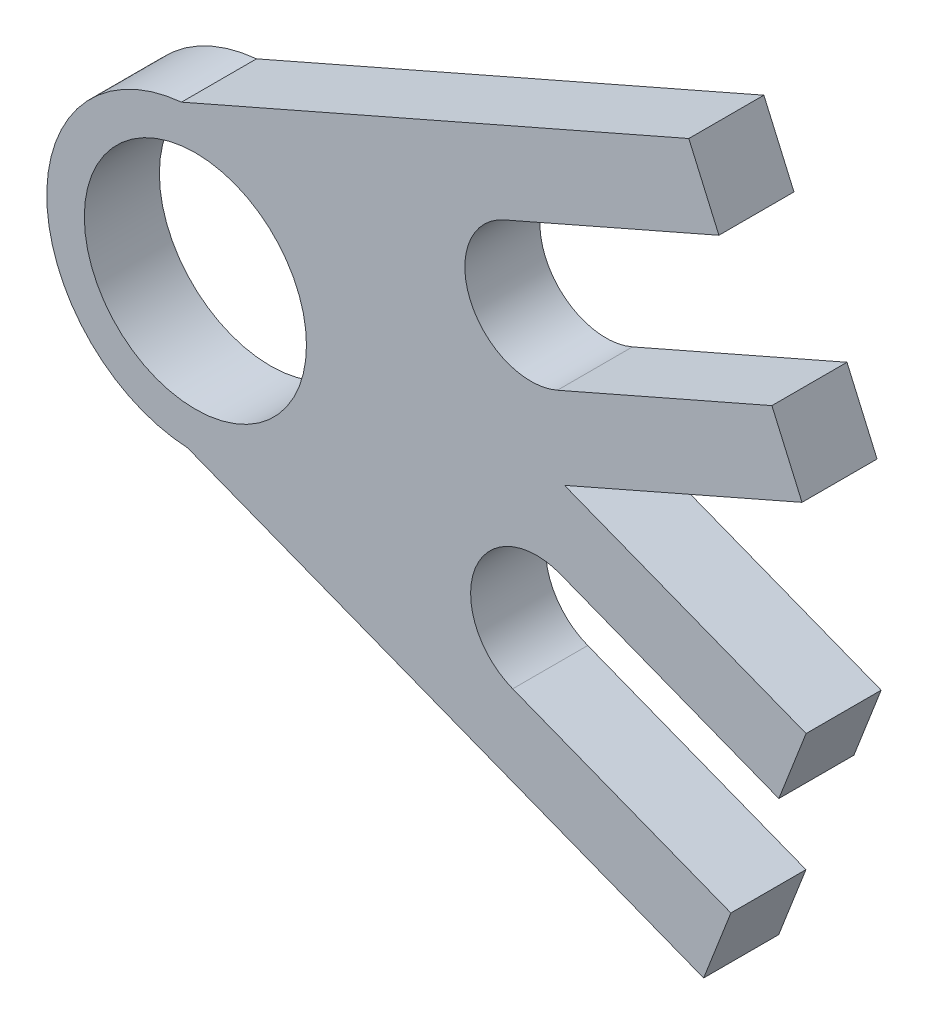
ISO-10303-21;
HEADER;
FILE_DESCRIPTION(('STEP AP214'),'2;1');
FILE_NAME('part.step','',(''),(''),'','','');
FILE_SCHEMA(('AUTOMOTIVE_DESIGN { 1 0 10303 214 1 1 1 1 }'));
ENDSEC;
DATA;
#1=APPLICATION_CONTEXT('core data for automotive mechanical design processes');
#2=APPLICATION_PROTOCOL_DEFINITION('international standard','automotive_design',2000,#1);
#3=PRODUCT_CONTEXT('',#1,'mechanical');
#4=PRODUCT('Part','Part','',(#3));
#5=PRODUCT_RELATED_PRODUCT_CATEGORY('part','',(#4));
#6=PRODUCT_DEFINITION_FORMATION('','',#4);
#7=PRODUCT_DEFINITION_CONTEXT('part definition',#1,'design');
#8=PRODUCT_DEFINITION('design','',#6,#7);
#9=PRODUCT_DEFINITION_SHAPE('','',#8);
#10=(LENGTH_UNIT() NAMED_UNIT(*) SI_UNIT(.MILLI.,.METRE.));
#11=(NAMED_UNIT(*) PLANE_ANGLE_UNIT() SI_UNIT($,.RADIAN.));
#12=(NAMED_UNIT(*) SI_UNIT($,.STERADIAN.) SOLID_ANGLE_UNIT());
#13=UNCERTAINTY_MEASURE_WITH_UNIT(LENGTH_MEASURE(1.E-05),#10,'distance_accuracy_value','');
#14=(GEOMETRIC_REPRESENTATION_CONTEXT(3) GLOBAL_UNCERTAINTY_ASSIGNED_CONTEXT((#13)) GLOBAL_UNIT_ASSIGNED_CONTEXT((#10,
#11,#12)) REPRESENTATION_CONTEXT('',''));
#15=CARTESIAN_POINT('',(0.,0.,0.));
#16=DIRECTION('',(0.,0.,1.));
#17=DIRECTION('',(1.,0.,0.));
#18=AXIS2_PLACEMENT_3D('',#15,#16,#17);
#19=CARTESIAN_POINT('',(-581.214542671151,3.54310745627306,3.175));
#20=DIRECTION('',(0.,0.,-1.));
#21=DIRECTION('',(-1.,0.,0.));
#22=AXIS2_PLACEMENT_3D('',#19,#20,#21);
#23=CYLINDRICAL_SURFACE('',#22,5.58800000000007);
#24=CARTESIAN_POINT('',(-581.214542671151,3.54310745627306,-3.175));
#25=DIRECTION('',(0.,0.,1.));
#26=DIRECTION('',(1.,0.,0.));
#27=AXIS2_PLACEMENT_3D('',#24,#25,#26);
#28=CIRCLE('',#27,5.58800000000007);
#29=CARTESIAN_POINT('',(-583.45614179897,8.66179648278773,-3.175));
#30=VERTEX_POINT('',#29);
#31=CARTESIAN_POINT('',(-578.972943543332,-1.57558157024162,-3.175));
#32=VERTEX_POINT('',#31);
#33=EDGE_CURVE('E175',#30,#32,#28,.T.);
#34=ORIENTED_EDGE('',*,*,#33,.F.);
#35=DIRECTION('',(0.,0.,-1.));
#36=VECTOR('',#35,1.);
#37=CARTESIAN_POINT('',(-583.45614179897,8.66179648278773,3.175));
#38=LINE('',#37,#36);
#39=CARTESIAN_POINT('',(-583.45614179897,8.66179648278773,3.175));
#40=VERTEX_POINT('',#39);
#41=EDGE_CURVE('E11',#40,#30,#38,.T.);
#42=ORIENTED_EDGE('',*,*,#41,.F.);
#43=CARTESIAN_POINT('',(-581.214542671151,3.54310745627306,3.175));
#44=DIRECTION('',(0.,0.,1.));
#45=DIRECTION('',(1.,0.,0.));
#46=AXIS2_PLACEMENT_3D('',#43,#44,#45);
#47=CIRCLE('',#46,5.58800000000007);
#48=CARTESIAN_POINT('',(-578.972943543332,-1.57558157024162,3.175));
#49=VERTEX_POINT('',#48);
#50=EDGE_CURVE('E214',#40,#49,#47,.T.);
#51=ORIENTED_EDGE('',*,*,#50,.T.);
#52=DIRECTION('',(0.,0.,-1.));
#53=VECTOR('',#52,1.);
#54=CARTESIAN_POINT('',(-578.972943543332,-1.57558157024162,3.175));
#55=LINE('',#54,#53);
#56=EDGE_CURVE('E52',#49,#32,#55,.T.);
#57=ORIENTED_EDGE('',*,*,#56,.T.);
#58=EDGE_LOOP('',(#34,#42,#51,#57));
#59=FACE_BOUND('',#58,.T.);
#60=ADVANCED_FACE('F36',(#59),#23,.F.);
#61=CARTESIAN_POINT('',(-97.0710846470642,221.661709985696,3.175));
#62=DIRECTION('',(-0.401145155300462,0.916014500092094,0.));
#63=DIRECTION('',(-0.916014500092094,-0.401145155300462,0.));
#64=AXIS2_PLACEMENT_3D('',#61,#62,#63);
#65=PLANE('',#64);
#66=DIRECTION('',(0.916014500092094,0.401145155300462,0.));
#67=VECTOR('',#66,1.);
#68=CARTESIAN_POINT('',(-97.0710846470642,221.661709985696,-3.175));
#69=LINE('',#68,#67);
#70=CARTESIAN_POINT('',(-565.30806252314,16.6092842996026,-3.175));
#71=VERTEX_POINT('',#70);
#72=EDGE_CURVE('E177',#30,#71,#69,.T.);
#73=ORIENTED_EDGE('',*,*,#72,.T.);
#74=DIRECTION('',(0.,0.,-1.));
#75=VECTOR('',#74,1.);
#76=CARTESIAN_POINT('',(-565.30806252314,16.6092842996026,3.175));
#77=LINE('',#76,#75);
#78=CARTESIAN_POINT('',(-565.30806252314,16.6092842996026,3.175));
#79=VERTEX_POINT('',#78);
#80=EDGE_CURVE('E44',#79,#71,#77,.T.);
#81=ORIENTED_EDGE('',*,*,#80,.F.);
#82=DIRECTION('',(0.916014500092094,0.401145155300462,0.));
#83=VECTOR('',#82,1.);
#84=CARTESIAN_POINT('',(-97.0710846470642,221.661709985696,3.175));
#85=LINE('',#84,#83);
#86=EDGE_CURVE('E470',#40,#79,#85,.T.);
#87=ORIENTED_EDGE('',*,*,#86,.F.);
#88=ORIENTED_EDGE('',*,*,#41,.T.);
#89=EDGE_LOOP('',(#73,#81,#87,#88));
#90=FACE_BOUND('',#89,.T.);
#91=ADVANCED_FACE('F307',(#90),#65,.F.);
#92=CARTESIAN_POINT('',(-468.236977876058,-205.052425686108,3.175));
#93=DIRECTION('',(-0.916014500092077,-0.4011451553005,0.));
#94=DIRECTION('',(0.4011451553005,-0.916014500092077,0.));
#95=AXIS2_PLACEMENT_3D('',#92,#93,#94);
#96=PLANE('',#95);
#97=DIRECTION('',(-0.4011451553005,0.916014500092077,0.));
#98=VECTOR('',#97,1.);
#99=CARTESIAN_POINT('',(-468.236977876058,-205.052425686108,-3.175));
#100=LINE('',#99,#98);
#101=CARTESIAN_POINT('',(-567.855334259299,22.4259763751874,-3.175));
#102=VERTEX_POINT('',#101);
#103=EDGE_CURVE('E179',#71,#102,#100,.T.);
#104=ORIENTED_EDGE('',*,*,#103,.T.);
#105=DIRECTION('',(0.,0.,-1.));
#106=VECTOR('',#105,1.);
#107=CARTESIAN_POINT('',(-567.855334259299,22.4259763751874,3.175));
#108=LINE('',#107,#106);
#109=CARTESIAN_POINT('',(-567.855334259299,22.4259763751874,3.175));
#110=VERTEX_POINT('',#109);
#111=EDGE_CURVE('E237',#110,#102,#108,.T.);
#112=ORIENTED_EDGE('',*,*,#111,.F.);
#113=DIRECTION('',(-0.4011451553005,0.916014500092077,0.));
#114=VECTOR('',#113,1.);
#115=CARTESIAN_POINT('',(-468.236977876058,-205.052425686108,3.175));
#116=LINE('',#115,#114);
#117=EDGE_CURVE('E246',#79,#110,#116,.T.);
#118=ORIENTED_EDGE('',*,*,#117,.F.);
#119=ORIENTED_EDGE('',*,*,#80,.T.);
#120=EDGE_LOOP('',(#104,#112,#118,#119));
#121=FACE_BOUND('',#120,.T.);
#122=ADVANCED_FACE('F244',(#121),#96,.F.);
#123=CARTESIAN_POINT('',(-99.6183563832226,227.478402061281,3.175));
#124=DIRECTION('',(0.401145155300463,-0.916014500092093,0.));
#125=DIRECTION('',(0.916014500092093,0.401145155300463,0.));
#126=AXIS2_PLACEMENT_3D('',#123,#124,#125);
#127=PLANE('',#126);
#128=DIRECTION('',(-0.916014500092093,-0.401145155300463,0.));
#129=VECTOR('',#128,1.);
#130=CARTESIAN_POINT('',(-99.6183563832226,227.478402061281,-3.175));
#131=LINE('',#130,#129);
#132=CARTESIAN_POINT('',(-610.775024161772,3.63039435149163,-3.175));
#133=VERTEX_POINT('',#132);
#134=EDGE_CURVE('E181',#102,#133,#131,.T.);
#135=ORIENTED_EDGE('',*,*,#134,.T.);
#136=DIRECTION('',(0.,0.,-1.));
#137=VECTOR('',#136,1.);
#138=CARTESIAN_POINT('',(-610.775024161772,3.63039435149163,3.175));
#139=LINE('',#138,#137);
#140=CARTESIAN_POINT('',(-610.775024161772,3.63039435149163,3.175));
#141=VERTEX_POINT('',#140);
#142=EDGE_CURVE('E234',#141,#133,#139,.T.);
#143=ORIENTED_EDGE('',*,*,#142,.F.);
#144=DIRECTION('',(-0.916014500092093,-0.401145155300463,0.));
#145=VECTOR('',#144,1.);
#146=CARTESIAN_POINT('',(-99.6183563832226,227.478402061281,3.175));
#147=LINE('',#146,#145);
#148=EDGE_CURVE('E266',#110,#141,#147,.T.);
#149=ORIENTED_EDGE('',*,*,#148,.F.);
#150=ORIENTED_EDGE('',*,*,#111,.T.);
#151=EDGE_LOOP('',(#135,#143,#149,#150));
#152=FACE_BOUND('',#151,.T.);
#153=ADVANCED_FACE('F256',(#152),#127,.F.);
#154=CARTESIAN_POINT('',(-609.6,-8.88757861617569,3.175));
#155=DIRECTION('',(0.,0.,-1.));
#156=DIRECTION('',(-1.,0.,0.));
#157=AXIS2_PLACEMENT_3D('',#154,#155,#156);
#158=CYLINDRICAL_SURFACE('',#157,12.5729999999999);
#159=CARTESIAN_POINT('',(-609.6,-8.88757861617569,-3.175));
#160=DIRECTION('',(0.,0.,1.));
#161=DIRECTION('',(1.,0.,0.));
#162=AXIS2_PLACEMENT_3D('',#159,#160,#161);
#163=CIRCLE('',#162,12.5729999999999);
#164=CARTESIAN_POINT('',(-610.258379573321,-21.4433289058809,-3.175));
#165=VERTEX_POINT('',#164);
#166=EDGE_CURVE('E183',#133,#165,#163,.T.);
#167=ORIENTED_EDGE('',*,*,#166,.T.);
#168=DIRECTION('',(0.,0.,-1.));
#169=VECTOR('',#168,1.);
#170=CARTESIAN_POINT('',(-610.258379573321,-21.4433289058809,3.175));
#171=LINE('',#170,#169);
#172=CARTESIAN_POINT('',(-610.258379573321,-21.4433289058809,3.175));
#173=VERTEX_POINT('',#172);
#174=EDGE_CURVE('E232',#173,#165,#171,.T.);
#175=ORIENTED_EDGE('',*,*,#174,.F.);
#176=CARTESIAN_POINT('',(-609.6,-8.88757861617569,3.175));
#177=DIRECTION('',(0.,0.,1.));
#178=DIRECTION('',(1.,0.,0.));
#179=AXIS2_PLACEMENT_3D('',#176,#177,#178);
#180=CIRCLE('',#179,12.5729999999999);
#181=EDGE_CURVE('E262',#141,#173,#180,.T.);
#182=ORIENTED_EDGE('',*,*,#181,.F.);
#183=ORIENTED_EDGE('',*,*,#142,.T.);
#184=EDGE_LOOP('',(#167,#175,#182,#183));
#185=FACE_BOUND('',#184,.T.);
#186=ADVANCED_FACE('F260',(#185),#158,.T.);
#187=CARTESIAN_POINT('',(-87.6991004533568,-225.064690467357,3.175));
#188=DIRECTION('',(-0.363071698537952,-0.931761204236776,0.));
#189=DIRECTION('',(0.931761204236776,-0.363071698537952,0.));
#190=AXIS2_PLACEMENT_3D('',#187,#188,#189);
#191=PLANE('',#190);
#192=DIRECTION('',(-0.931761204236776,0.363071698537952,0.));
#193=VECTOR('',#192,1.);
#194=CARTESIAN_POINT('',(-87.6991004533568,-225.064690467357,-3.175));
#195=LINE('',#194,#193);
#196=CARTESIAN_POINT('',(-566.600880761918,-38.4549861580823,-3.175));
#197=VERTEX_POINT('',#196);
#198=EDGE_CURVE('E186',#197,#165,#195,.T.);
#199=ORIENTED_EDGE('',*,*,#198,.F.);
#200=DIRECTION('',(0.,0.,-1.));
#201=VECTOR('',#200,1.);
#202=CARTESIAN_POINT('',(-566.600880761918,-38.4549861580823,3.175));
#203=LINE('',#202,#201);
#204=CARTESIAN_POINT('',(-566.600880761918,-38.4549861580823,3.175));
#205=VERTEX_POINT('',#204);
#206=EDGE_CURVE('E230',#205,#197,#203,.T.);
#207=ORIENTED_EDGE('',*,*,#206,.F.);
#208=DIRECTION('',(-0.931761204236776,0.363071698537952,0.));
#209=VECTOR('',#208,1.);
#210=CARTESIAN_POINT('',(-87.6991004533568,-225.064690467357,3.175));
#211=LINE('',#210,#209);
#212=EDGE_CURVE('E265',#205,#173,#211,.T.);
#213=ORIENTED_EDGE('',*,*,#212,.T.);
#214=ORIENTED_EDGE('',*,*,#174,.T.);
#215=EDGE_LOOP('',(#199,#207,#213,#214));
#216=FACE_BOUND('',#215,.T.);
#217=ADVANCED_FACE('F320',(#216),#191,.T.);
#218=CARTESIAN_POINT('',(-478.90178030859,186.609704309248,3.175));
#219=DIRECTION('',(0.931761204236801,-0.363071698537887,0.));
#220=DIRECTION('',(0.363071698537888,0.931761204236801,0.));
#221=AXIS2_PLACEMENT_3D('',#218,#219,#220);
#222=PLANE('',#221);
#223=DIRECTION('',(-0.363071698537887,-0.931761204236801,0.));
#224=VECTOR('',#223,1.);
#225=CARTESIAN_POINT('',(-478.90178030859,186.609704309248,-3.175));
#226=LINE('',#225,#224);
#227=CARTESIAN_POINT('',(-564.295375476203,-32.5383025111786,-3.175));
#228=VERTEX_POINT('',#227);
#229=EDGE_CURVE('E189',#228,#197,#226,.T.);
#230=ORIENTED_EDGE('',*,*,#229,.F.);
#231=DIRECTION('',(0.,0.,-1.));
#232=VECTOR('',#231,1.);
#233=CARTESIAN_POINT('',(-564.295375476203,-32.5383025111786,3.175));
#234=LINE('',#233,#232);
#235=CARTESIAN_POINT('',(-564.295375476203,-32.5383025111786,3.175));
#236=VERTEX_POINT('',#235);
#237=EDGE_CURVE('E228',#236,#228,#234,.T.);
#238=ORIENTED_EDGE('',*,*,#237,.F.);
#239=DIRECTION('',(-0.363071698537887,-0.931761204236801,0.));
#240=VECTOR('',#239,1.);
#241=CARTESIAN_POINT('',(-478.90178030859,186.609704309248,3.175));
#242=LINE('',#241,#240);
#243=EDGE_CURVE('E268',#236,#205,#242,.T.);
#244=ORIENTED_EDGE('',*,*,#243,.T.);
#245=ORIENTED_EDGE('',*,*,#206,.T.);
#246=EDGE_LOOP('',(#230,#238,#244,#245));
#247=FACE_BOUND('',#246,.T.);
#248=ADVANCED_FACE('F323',(#247),#222,.T.);
#249=CARTESIAN_POINT('',(-85.3935951676427,-219.148006820455,3.175));
#250=DIRECTION('',(0.363071698537956,0.931761204236774,0.));
#251=DIRECTION('',(-0.931761204236774,0.363071698537956,0.));
#252=AXIS2_PLACEMENT_3D('',#249,#250,#251);
#253=PLANE('',#252);
#254=DIRECTION('',(0.931761204236774,-0.363071698537956,0.));
#255=VECTOR('',#254,1.);
#256=CARTESIAN_POINT('',(-85.3935951676427,-219.148006820455,-3.175));
#257=LINE('',#256,#255);
#258=CARTESIAN_POINT('',(-582.755428454541,-25.345126019745,-3.175));
#259=VERTEX_POINT('',#258);
#260=EDGE_CURVE('E192',#259,#228,#257,.T.);
#261=ORIENTED_EDGE('',*,*,#260,.F.);
#262=DIRECTION('',(0.,0.,-1.));
#263=VECTOR('',#262,1.);
#264=CARTESIAN_POINT('',(-582.755428454541,-25.345126019745,3.175));
#265=LINE('',#264,#263);
#266=CARTESIAN_POINT('',(-582.755428454541,-25.345126019745,3.175));
#267=VERTEX_POINT('',#266);
#268=EDGE_CURVE('E226',#267,#259,#265,.T.);
#269=ORIENTED_EDGE('',*,*,#268,.F.);
#270=DIRECTION('',(0.931761204236774,-0.363071698537956,0.));
#271=VECTOR('',#270,1.);
#272=CARTESIAN_POINT('',(-85.3935951676427,-219.148006820455,3.175));
#273=LINE('',#272,#271);
#274=EDGE_CURVE('E275',#267,#236,#273,.T.);
#275=ORIENTED_EDGE('',*,*,#274,.T.);
#276=ORIENTED_EDGE('',*,*,#237,.T.);
#277=EDGE_LOOP('',(#261,#269,#275,#276));
#278=FACE_BOUND('',#277,.T.);
#279=ADVANCED_FACE('F327',(#278),#253,.T.);
#280=CARTESIAN_POINT('',(-580.726583803111,-20.1384444104696,3.175));
#281=DIRECTION('',(0.,0.,-1.));
#282=DIRECTION('',(-1.,0.,0.));
#283=AXIS2_PLACEMENT_3D('',#280,#281,#282);
#284=CYLINDRICAL_SURFACE('',#283,5.58800000000019);
#285=CARTESIAN_POINT('',(-580.726583803111,-20.1384444104696,-3.175));
#286=DIRECTION('',(0.,0.,1.));
#287=DIRECTION('',(1.,0.,0.));
#288=AXIS2_PLACEMENT_3D('',#285,#286,#287);
#289=CIRCLE('',#288,5.58800000000019);
#290=CARTESIAN_POINT('',(-578.697739151681,-14.9317628011944,-3.175));
#291=VERTEX_POINT('',#290);
#292=EDGE_CURVE('E195',#291,#259,#289,.T.);
#293=ORIENTED_EDGE('',*,*,#292,.F.);
#294=DIRECTION('',(0.,0.,-1.));
#295=VECTOR('',#294,1.);
#296=CARTESIAN_POINT('',(-578.697739151681,-14.9317628011944,3.175));
#297=LINE('',#296,#295);
#298=CARTESIAN_POINT('',(-578.697739151681,-14.9317628011944,3.175));
#299=VERTEX_POINT('',#298);
#300=EDGE_CURVE('E224',#299,#291,#297,.T.);
#301=ORIENTED_EDGE('',*,*,#300,.F.);
#302=CARTESIAN_POINT('',(-580.726583803111,-20.1384444104696,3.175));
#303=DIRECTION('',(0.,0.,1.));
#304=DIRECTION('',(1.,0.,0.));
#305=AXIS2_PLACEMENT_3D('',#302,#303,#304);
#306=CIRCLE('',#305,5.58800000000019);
#307=EDGE_CURVE('E278',#299,#267,#306,.T.);
#308=ORIENTED_EDGE('',*,*,#307,.T.);
#309=ORIENTED_EDGE('',*,*,#268,.T.);
#310=EDGE_LOOP('',(#293,#301,#308,#309));
#311=FACE_BOUND('',#310,.T.);
#312=ADVANCED_FACE('F331',(#311),#284,.F.);
#313=CARTESIAN_POINT('',(-81.3359058647786,-208.734643601901,3.175));
#314=DIRECTION('',(0.363071698537947,0.931761204236777,0.));
#315=DIRECTION('',(-0.931761204236778,0.363071698537948,0.));
#316=AXIS2_PLACEMENT_3D('',#313,#314,#315);
#317=PLANE('',#316);
#318=DIRECTION('',(0.931761204236778,-0.363071698537948,0.));
#319=VECTOR('',#318,1.);
#320=CARTESIAN_POINT('',(-81.3359058647786,-208.734643601901,-3.175));
#321=LINE('',#320,#319);
#322=CARTESIAN_POINT('',(-560.237686173343,-22.1249392926279,-3.175));
#323=VERTEX_POINT('',#322);
#324=EDGE_CURVE('E198',#291,#323,#321,.T.);
#325=ORIENTED_EDGE('',*,*,#324,.T.);
#326=DIRECTION('',(0.,0.,-1.));
#327=VECTOR('',#326,1.);
#328=CARTESIAN_POINT('',(-560.237686173343,-22.1249392926279,3.175));
#329=LINE('',#328,#327);
#330=CARTESIAN_POINT('',(-560.237686173343,-22.1249392926279,3.175));
#331=VERTEX_POINT('',#330);
#332=EDGE_CURVE('E221',#331,#323,#329,.T.);
#333=ORIENTED_EDGE('',*,*,#332,.F.);
#334=DIRECTION('',(0.931761204236778,-0.363071698537948,0.));
#335=VECTOR('',#334,1.);
#336=CARTESIAN_POINT('',(-81.3359058647786,-208.734643601901,3.175));
#337=LINE('',#336,#335);
#338=EDGE_CURVE('E281',#299,#331,#337,.T.);
#339=ORIENTED_EDGE('',*,*,#338,.F.);
#340=ORIENTED_EDGE('',*,*,#300,.T.);
#341=EDGE_LOOP('',(#325,#333,#339,#340));
#342=FACE_BOUND('',#341,.T.);
#343=ADVANCED_FACE('F335',(#342),#317,.F.);
#344=CARTESIAN_POINT('',(-478.901780308537,186.6097043093,3.175));
#345=DIRECTION('',(-0.931761204236753,0.363071698538011,0.));
#346=DIRECTION('',(-0.363071698538011,-0.931761204236753,0.));
#347=AXIS2_PLACEMENT_3D('',#344,#345,#346);
#348=PLANE('',#347);
#349=DIRECTION('',(0.363071698538011,0.931761204236753,0.));
#350=VECTOR('',#349,1.);
#351=CARTESIAN_POINT('',(-478.901780308537,186.6097043093,-3.175));
#352=LINE('',#351,#350);
#353=CARTESIAN_POINT('',(-557.932180887626,-16.2082556457244,-3.175));
#354=VERTEX_POINT('',#353);
#355=EDGE_CURVE('E200',#323,#354,#352,.T.);
#356=ORIENTED_EDGE('',*,*,#355,.T.);
#357=DIRECTION('',(0.,0.,-1.));
#358=VECTOR('',#357,1.);
#359=CARTESIAN_POINT('',(-557.932180887626,-16.2082556457244,3.175));
#360=LINE('',#359,#358);
#361=CARTESIAN_POINT('',(-557.932180887626,-16.2082556457244,3.175));
#362=VERTEX_POINT('',#361);
#363=EDGE_CURVE('E218',#362,#354,#360,.T.);
#364=ORIENTED_EDGE('',*,*,#363,.F.);
#365=DIRECTION('',(0.363071698538011,0.931761204236753,0.));
#366=VECTOR('',#365,1.);
#367=CARTESIAN_POINT('',(-478.901780308537,186.6097043093,3.175));
#368=LINE('',#367,#366);
#369=EDGE_CURVE('E283',#331,#362,#368,.T.);
#370=ORIENTED_EDGE('',*,*,#369,.F.);
#371=ORIENTED_EDGE('',*,*,#332,.T.);
#372=EDGE_LOOP('',(#356,#364,#370,#371));
#373=FACE_BOUND('',#372,.T.);
#374=ADVANCED_FACE('F290',(#373),#348,.F.);
#375=CARTESIAN_POINT('',(-79.0304005790641,-202.817959954999,3.175));
#376=DIRECTION('',(-0.363071698537951,-0.931761204236776,0.));
#377=DIRECTION('',(0.931761204236776,-0.363071698537951,0.));
#378=AXIS2_PLACEMENT_3D('',#375,#376,#377);
#379=PLANE('',#378);
#380=DIRECTION('',(-0.931761204236776,0.363071698537951,0.));
#381=VECTOR('',#380,1.);
#382=CARTESIAN_POINT('',(-79.0304005790641,-202.817959954999,-3.175));
#383=LINE('',#382,#381);
#384=CARTESIAN_POINT('',(-578.370817833612,-8.24410066906603,-3.175));
#385=VERTEX_POINT('',#384);
#386=EDGE_CURVE('E202',#354,#385,#383,.T.);
#387=ORIENTED_EDGE('',*,*,#386,.T.);
#388=DIRECTION('',(0.,0.,-1.));
#389=VECTOR('',#388,1.);
#390=CARTESIAN_POINT('',(-578.370817833612,-8.24410066906603,3.175));
#391=LINE('',#390,#389);
#392=CARTESIAN_POINT('',(-578.370817833612,-8.24410066906603,3.175));
#393=VERTEX_POINT('',#392);
#394=EDGE_CURVE('E153',#393,#385,#391,.T.);
#395=ORIENTED_EDGE('',*,*,#394,.F.);
#396=DIRECTION('',(-0.931761204236776,0.363071698537951,0.));
#397=VECTOR('',#396,1.);
#398=CARTESIAN_POINT('',(-79.0304005790641,-202.817959954999,3.175));
#399=LINE('',#398,#397);
#400=EDGE_CURVE('E163',#362,#393,#399,.T.);
#401=ORIENTED_EDGE('',*,*,#400,.F.);
#402=ORIENTED_EDGE('',*,*,#363,.T.);
#403=EDGE_LOOP('',(#387,#395,#401,#402));
#404=FACE_BOUND('',#403,.T.);
#405=ADVANCED_FACE('F294',(#404),#379,.F.);
#406=CARTESIAN_POINT('',(-90.0406146552676,205.607639857081,3.175));
#407=DIRECTION('',(0.401145155300461,-0.916014500092094,0.));
#408=DIRECTION('',(0.916014500092094,0.401145155300461,0.));
#409=AXIS2_PLACEMENT_3D('',#406,#407,#408);
#410=PLANE('',#409);
#411=DIRECTION('',(-0.916014500092094,-0.401145155300461,0.));
#412=VECTOR('',#411,1.);
#413=CARTESIAN_POINT('',(-90.0406146552676,205.607639857081,-3.175));
#414=LINE('',#413,#412);
#415=CARTESIAN_POINT('',(-558.277592531345,0.555214170988277,-3.175));
#416=VERTEX_POINT('',#415);
#417=EDGE_CURVE('E149',#416,#385,#414,.T.);
#418=ORIENTED_EDGE('',*,*,#417,.F.);
#419=DIRECTION('',(0.,0.,-1.));
#420=VECTOR('',#419,1.);
#421=CARTESIAN_POINT('',(-558.277592531345,0.555214170988277,3.175));
#422=LINE('',#421,#420);
#423=CARTESIAN_POINT('',(-558.277592531345,0.555214170988277,3.175));
#424=VERTEX_POINT('',#423);
#425=EDGE_CURVE('E144',#424,#416,#422,.T.);
#426=ORIENTED_EDGE('',*,*,#425,.F.);
#427=DIRECTION('',(-0.916014500092094,-0.401145155300461,0.));
#428=VECTOR('',#427,1.);
#429=CARTESIAN_POINT('',(-90.0406146552676,205.607639857081,3.175));
#430=LINE('',#429,#428);
#431=EDGE_CURVE('E147',#424,#393,#430,.T.);
#432=ORIENTED_EDGE('',*,*,#431,.T.);
#433=ORIENTED_EDGE('',*,*,#394,.T.);
#434=EDGE_LOOP('',(#418,#426,#432,#433));
#435=FACE_BOUND('',#434,.T.);
#436=ADVANCED_FACE('F146',(#435),#410,.T.);
#437=CARTESIAN_POINT('',(-468.236977876091,-205.052425686079,3.175));
#438=DIRECTION('',(0.916014500092108,0.401145155300429,0.));
#439=DIRECTION('',(-0.401145155300429,0.916014500092108,0.));
#440=AXIS2_PLACEMENT_3D('',#437,#438,#439);
#441=PLANE('',#440);
#442=DIRECTION('',(0.401145155300429,-0.916014500092108,0.));
#443=VECTOR('',#442,1.);
#444=CARTESIAN_POINT('',(-468.236977876091,-205.052425686079,-3.175));
#445=LINE('',#444,#443);
#446=CARTESIAN_POINT('',(-560.824864267502,6.37190624657327,-3.175));
#447=VERTEX_POINT('',#446);
#448=EDGE_CURVE('E206',#447,#416,#445,.T.);
#449=ORIENTED_EDGE('',*,*,#448,.F.);
#450=DIRECTION('',(0.,0.,-1.));
#451=VECTOR('',#450,1.);
#452=CARTESIAN_POINT('',(-560.824864267502,6.37190624657327,3.175));
#453=LINE('',#452,#451);
#454=CARTESIAN_POINT('',(-560.824864267502,6.37190624657327,3.175));
#455=VERTEX_POINT('',#454);
#456=EDGE_CURVE('E98',#455,#447,#453,.T.);
#457=ORIENTED_EDGE('',*,*,#456,.F.);
#458=DIRECTION('',(0.401145155300429,-0.916014500092108,0.));
#459=VECTOR('',#458,1.);
#460=CARTESIAN_POINT('',(-468.236977876091,-205.052425686079,3.175));
#461=LINE('',#460,#459);
#462=EDGE_CURVE('E161',#455,#424,#461,.T.);
#463=ORIENTED_EDGE('',*,*,#462,.T.);
#464=ORIENTED_EDGE('',*,*,#425,.T.);
#465=EDGE_LOOP('',(#449,#457,#463,#464));
#466=FACE_BOUND('',#465,.T.);
#467=ADVANCED_FACE('F166',(#466),#441,.T.);
#468=CARTESIAN_POINT('',(-92.5878863914263,211.424331932666,3.175));
#469=DIRECTION('',(-0.401145155300462,0.916014500092094,0.));
#470=DIRECTION('',(-0.916014500092094,-0.401145155300462,0.));
#471=AXIS2_PLACEMENT_3D('',#468,#469,#470);
#472=PLANE('',#471);
#473=DIRECTION('',(0.916014500092094,0.401145155300462,0.));
#474=VECTOR('',#473,1.);
#475=CARTESIAN_POINT('',(-92.5878863914263,211.424331932666,-3.175));
#476=LINE('',#475,#474);
#477=EDGE_CURVE('E208',#32,#447,#476,.T.);
#478=ORIENTED_EDGE('',*,*,#477,.F.);
#479=ORIENTED_EDGE('',*,*,#56,.F.);
#480=DIRECTION('',(0.916014500092094,0.401145155300462,0.));
#481=VECTOR('',#480,1.);
#482=CARTESIAN_POINT('',(-92.5878863914263,211.424331932666,3.175));
#483=LINE('',#482,#481);
#484=EDGE_CURVE('E167',#49,#455,#483,.T.);
#485=ORIENTED_EDGE('',*,*,#484,.T.);
#486=ORIENTED_EDGE('',*,*,#456,.T.);
#487=EDGE_LOOP('',(#478,#479,#485,#486));
#488=FACE_BOUND('',#487,.T.);
#489=ADVANCED_FACE('F295',(#488),#472,.T.);
#490=CARTESIAN_POINT('',(-609.6,-8.88757861617569,3.175));
#491=DIRECTION('',(0.,0.,-1.));
#492=DIRECTION('',(-1.,0.,0.));
#493=AXIS2_PLACEMENT_3D('',#490,#491,#492);
#494=CYLINDRICAL_SURFACE('',#493,9.39800000000006);
#495=CARTESIAN_POINT('',(-609.6,-8.88757861617569,3.175));
#496=DIRECTION('',(0.,0.,1.));
#497=DIRECTION('',(1.,0.,0.));
#498=AXIS2_PLACEMENT_3D('',#495,#496,#497);
#499=CIRCLE('',#498,9.39800000000006);
#500=CARTESIAN_POINT('',(-600.202,-8.88757861617569,3.175));
#501=VERTEX_POINT('',#500);
#502=EDGE_CURVE('E169',#501,#501,#499,.T.);
#503=ORIENTED_EDGE('',*,*,#502,.T.);
#504=EDGE_LOOP('',(#503));
#505=FACE_BOUND('',#504,.T.);
#506=CARTESIAN_POINT('',(-609.6,-8.88757861617569,-3.175));
#507=DIRECTION('',(0.,0.,1.));
#508=DIRECTION('',(1.,0.,0.));
#509=AXIS2_PLACEMENT_3D('',#506,#507,#508);
#510=CIRCLE('',#509,9.39800000000006);
#511=CARTESIAN_POINT('',(-600.202,-8.88757861617569,-3.175));
#512=VERTEX_POINT('',#511);
#513=EDGE_CURVE('E211',#512,#512,#510,.T.);
#514=ORIENTED_EDGE('',*,*,#513,.F.);
#515=EDGE_LOOP('',(#514));
#516=FACE_BOUND('',#515,.T.);
#517=ADVANCED_FACE('F297',(#505,#516),#494,.F.);
#518=CARTESIAN_POINT('',(0.,0.,3.175));
#519=DIRECTION('',(0.,0.,1.));
#520=DIRECTION('',(1.,0.,0.));
#521=AXIS2_PLACEMENT_3D('',#518,#519,#520);
#522=PLANE('',#521);
#523=ORIENTED_EDGE('',*,*,#50,.F.);
#524=ORIENTED_EDGE('',*,*,#86,.T.);
#525=ORIENTED_EDGE('',*,*,#117,.T.);
#526=ORIENTED_EDGE('',*,*,#148,.T.);
#527=ORIENTED_EDGE('',*,*,#181,.T.);
#528=ORIENTED_EDGE('',*,*,#212,.F.);
#529=ORIENTED_EDGE('',*,*,#243,.F.);
#530=ORIENTED_EDGE('',*,*,#274,.F.);
#531=ORIENTED_EDGE('',*,*,#307,.F.);
#532=ORIENTED_EDGE('',*,*,#338,.T.);
#533=ORIENTED_EDGE('',*,*,#369,.T.);
#534=ORIENTED_EDGE('',*,*,#400,.T.);
#535=ORIENTED_EDGE('',*,*,#431,.F.);
#536=ORIENTED_EDGE('',*,*,#462,.F.);
#537=ORIENTED_EDGE('',*,*,#484,.F.);
#538=EDGE_LOOP('',(#523,#524,#525,#526,#527,#528,#529,#530,#531,#532,#533,#534,#535,#536,#537));
#539=FACE_BOUND('',#538,.T.);
#540=ORIENTED_EDGE('',*,*,#502,.F.);
#541=EDGE_LOOP('',(#540));
#542=FACE_BOUND('',#541,.T.);
#543=ADVANCED_FACE('F158',(#539,#542),#522,.T.);
#544=CARTESIAN_POINT('',(0.,0.,-3.175));
#545=DIRECTION('',(0.,0.,1.));
#546=DIRECTION('',(1.,0.,0.));
#547=AXIS2_PLACEMENT_3D('',#544,#545,#546);
#548=PLANE('',#547);
#549=ORIENTED_EDGE('',*,*,#33,.T.);
#550=ORIENTED_EDGE('',*,*,#477,.T.);
#551=ORIENTED_EDGE('',*,*,#448,.T.);
#552=ORIENTED_EDGE('',*,*,#417,.T.);
#553=ORIENTED_EDGE('',*,*,#386,.F.);
#554=ORIENTED_EDGE('',*,*,#355,.F.);
#555=ORIENTED_EDGE('',*,*,#324,.F.);
#556=ORIENTED_EDGE('',*,*,#292,.T.);
#557=ORIENTED_EDGE('',*,*,#260,.T.);
#558=ORIENTED_EDGE('',*,*,#229,.T.);
#559=ORIENTED_EDGE('',*,*,#198,.T.);
#560=ORIENTED_EDGE('',*,*,#166,.F.);
#561=ORIENTED_EDGE('',*,*,#134,.F.);
#562=ORIENTED_EDGE('',*,*,#103,.F.);
#563=ORIENTED_EDGE('',*,*,#72,.F.);
#564=EDGE_LOOP('',(#549,#550,#551,#552,#553,#554,#555,#556,#557,#558,#559,#560,#561,#562,#563));
#565=FACE_BOUND('',#564,.T.);
#566=ORIENTED_EDGE('',*,*,#513,.T.);
#567=EDGE_LOOP('',(#566));
#568=FACE_BOUND('',#567,.T.);
#569=ADVANCED_FACE('F251',(#565,#568),#548,.F.);
#570=CLOSED_SHELL('',(#60,#91,#122,#153,#186,#217,#248,#279,#312,#343,#374,#405,#436,#467,#489,
#517,#543,#569));
#571=MANIFOLD_SOLID_BREP('B2',#570);
#572=ADVANCED_BREP_SHAPE_REPRESENTATION('',(#18,#571),#14);
#573=SHAPE_DEFINITION_REPRESENTATION(#9,#572);
ENDSEC;
END-ISO-10303-21;
